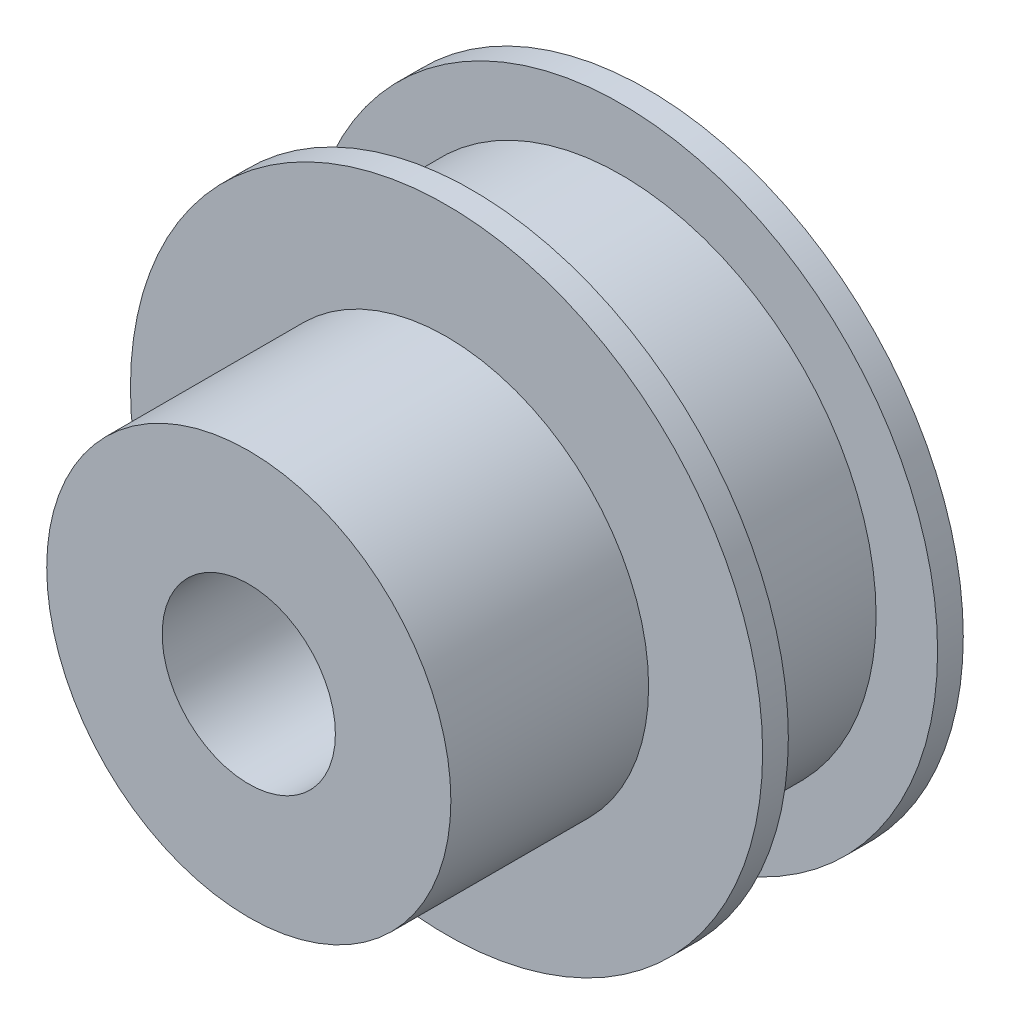
ISO-10303-21;
HEADER;
FILE_DESCRIPTION(('STEP AP214'),'2;1');
FILE_NAME('part.step','',(''),(''),'','','');
FILE_SCHEMA(('AUTOMOTIVE_DESIGN { 1 0 10303 214 1 1 1 1 }'));
ENDSEC;
DATA;
#1=APPLICATION_CONTEXT('core data for automotive mechanical design processes');
#2=APPLICATION_PROTOCOL_DEFINITION('international standard','automotive_design',2000,#1);
#3=PRODUCT_CONTEXT('',#1,'mechanical');
#4=PRODUCT('Part','Part','',(#3));
#5=PRODUCT_RELATED_PRODUCT_CATEGORY('part','',(#4));
#6=PRODUCT_DEFINITION_FORMATION('','',#4);
#7=PRODUCT_DEFINITION_CONTEXT('part definition',#1,'design');
#8=PRODUCT_DEFINITION('design','',#6,#7);
#9=PRODUCT_DEFINITION_SHAPE('','',#8);
#10=(LENGTH_UNIT() NAMED_UNIT(*) SI_UNIT(.MILLI.,.METRE.));
#11=(NAMED_UNIT(*) PLANE_ANGLE_UNIT() SI_UNIT($,.RADIAN.));
#12=(NAMED_UNIT(*) SI_UNIT($,.STERADIAN.) SOLID_ANGLE_UNIT());
#13=UNCERTAINTY_MEASURE_WITH_UNIT(LENGTH_MEASURE(1.E-05),#10,'distance_accuracy_value','');
#14=(GEOMETRIC_REPRESENTATION_CONTEXT(3) GLOBAL_UNCERTAINTY_ASSIGNED_CONTEXT((#13)) GLOBAL_UNIT_ASSIGNED_CONTEXT((#10,
#11,#12)) REPRESENTATION_CONTEXT('',''));
#15=CARTESIAN_POINT('',(0.,0.,0.));
#16=DIRECTION('',(0.,0.,1.));
#17=DIRECTION('',(1.,0.,0.));
#18=AXIS2_PLACEMENT_3D('',#15,#16,#17);
#19=CARTESIAN_POINT('',(0.,8.88999999999999,0.));
#20=DIRECTION('',(0.,0.,-1.));
#21=DIRECTION('',(-1.,0.,0.));
#22=AXIS2_PLACEMENT_3D('',#19,#20,#21);
#23=PLANE('',#22);
#24=CARTESIAN_POINT('',(0.,0.,0.));
#25=DIRECTION('',(0.,0.,1.));
#26=DIRECTION('',(1.,0.,0.));
#27=AXIS2_PLACEMENT_3D('',#24,#25,#26);
#28=CIRCLE('',#27,3.81);
#29=CARTESIAN_POINT('',(3.81,0.,0.));
#30=VERTEX_POINT('',#29);
#31=EDGE_CURVE('E10',#30,#30,#28,.T.);
#32=ORIENTED_EDGE('',*,*,#31,.F.);
#33=EDGE_LOOP('',(#32));
#34=FACE_BOUND('',#33,.T.);
#35=CARTESIAN_POINT('',(0.,0.,0.));
#36=DIRECTION('',(0.,0.,1.));
#37=DIRECTION('',(1.,0.,0.));
#38=AXIS2_PLACEMENT_3D('',#35,#36,#37);
#39=CIRCLE('',#38,8.88999999999999);
#40=CARTESIAN_POINT('',(8.88999999999999,0.,0.));
#41=VERTEX_POINT('',#40);
#42=EDGE_CURVE('E65',#41,#41,#39,.T.);
#43=ORIENTED_EDGE('',*,*,#42,.T.);
#44=EDGE_LOOP('',(#43));
#45=FACE_BOUND('',#44,.T.);
#46=ADVANCED_FACE('F31',(#34,#45),#23,.F.);
#47=CARTESIAN_POINT('',(0.,0.,0.));
#48=DIRECTION('',(0.,0.,1.));
#49=DIRECTION('',(1.,0.,0.));
#50=AXIS2_PLACEMENT_3D('',#47,#48,#49);
#51=CYLINDRICAL_SURFACE('',#50,3.81);
#52=CARTESIAN_POINT('',(0.,0.,-17.526));
#53=DIRECTION('',(0.,0.,1.));
#54=DIRECTION('',(1.,0.,0.));
#55=AXIS2_PLACEMENT_3D('',#52,#53,#54);
#56=CIRCLE('',#55,3.81);
#57=CARTESIAN_POINT('',(3.81,0.,-17.526));
#58=VERTEX_POINT('',#57);
#59=EDGE_CURVE('E37',#58,#58,#56,.T.);
#60=ORIENTED_EDGE('',*,*,#59,.F.);
#61=EDGE_LOOP('',(#60));
#62=FACE_BOUND('',#61,.T.);
#63=ORIENTED_EDGE('',*,*,#31,.T.);
#64=EDGE_LOOP('',(#63));
#65=FACE_BOUND('',#64,.T.);
#66=ADVANCED_FACE('F114',(#62,#65),#51,.F.);
#67=CARTESIAN_POINT('',(0.,3.81,-17.526));
#68=DIRECTION('',(0.,0.,1.));
#69=DIRECTION('',(1.,0.,0.));
#70=AXIS2_PLACEMENT_3D('',#67,#68,#69);
#71=PLANE('',#70);
#72=CARTESIAN_POINT('',(0.,0.,-17.526));
#73=DIRECTION('',(0.,0.,1.));
#74=DIRECTION('',(1.,0.,0.));
#75=AXIS2_PLACEMENT_3D('',#72,#73,#74);
#76=CIRCLE('',#75,13.9065);
#77=CARTESIAN_POINT('',(13.9065,0.,-17.526));
#78=VERTEX_POINT('',#77);
#79=EDGE_CURVE('E41',#78,#78,#76,.T.);
#80=ORIENTED_EDGE('',*,*,#79,.F.);
#81=EDGE_LOOP('',(#80));
#82=FACE_BOUND('',#81,.T.);
#83=ORIENTED_EDGE('',*,*,#59,.T.);
#84=EDGE_LOOP('',(#83));
#85=FACE_BOUND('',#84,.T.);
#86=ADVANCED_FACE('F109',(#82,#85),#71,.F.);
#87=CARTESIAN_POINT('',(0.,0.,0.));
#88=DIRECTION('',(0.,0.,1.));
#89=DIRECTION('',(1.,0.,0.));
#90=AXIS2_PLACEMENT_3D('',#87,#88,#89);
#91=CYLINDRICAL_SURFACE('',#90,13.9065);
#92=CARTESIAN_POINT('',(0.,0.,-16.3957));
#93=DIRECTION('',(0.,0.,1.));
#94=DIRECTION('',(1.,0.,0.));
#95=AXIS2_PLACEMENT_3D('',#92,#93,#94);
#96=CIRCLE('',#95,13.9065);
#97=CARTESIAN_POINT('',(13.9065,0.,-16.3957));
#98=VERTEX_POINT('',#97);
#99=EDGE_CURVE('E45',#98,#98,#96,.T.);
#100=ORIENTED_EDGE('',*,*,#99,.F.);
#101=EDGE_LOOP('',(#100));
#102=FACE_BOUND('',#101,.T.);
#103=ORIENTED_EDGE('',*,*,#79,.T.);
#104=EDGE_LOOP('',(#103));
#105=FACE_BOUND('',#104,.T.);
#106=ADVANCED_FACE('F103',(#102,#105),#91,.T.);
#107=CARTESIAN_POINT('',(0.,13.9065,-16.3957));
#108=DIRECTION('',(0.,0.,-1.));
#109=DIRECTION('',(-1.,0.,0.));
#110=AXIS2_PLACEMENT_3D('',#107,#108,#109);
#111=PLANE('',#110);
#112=CARTESIAN_POINT('',(0.,0.,-16.3957));
#113=DIRECTION('',(0.,0.,1.));
#114=DIRECTION('',(1.,0.,0.));
#115=AXIS2_PLACEMENT_3D('',#112,#113,#114);
#116=CIRCLE('',#115,11.2014);
#117=CARTESIAN_POINT('',(11.2014,0.,-16.3957));
#118=VERTEX_POINT('',#117);
#119=EDGE_CURVE('E50',#118,#118,#116,.T.);
#120=ORIENTED_EDGE('',*,*,#119,.F.);
#121=EDGE_LOOP('',(#120));
#122=FACE_BOUND('',#121,.T.);
#123=ORIENTED_EDGE('',*,*,#99,.T.);
#124=EDGE_LOOP('',(#123));
#125=FACE_BOUND('',#124,.T.);
#126=ADVANCED_FACE('F97',(#122,#125),#111,.F.);
#127=CARTESIAN_POINT('',(0.,0.,0.));
#128=DIRECTION('',(0.,0.,1.));
#129=DIRECTION('',(1.,0.,0.));
#130=AXIS2_PLACEMENT_3D('',#127,#128,#129);
#131=CYLINDRICAL_SURFACE('',#130,11.2014);
#132=CARTESIAN_POINT('',(0.,0.,-9.8298));
#133=DIRECTION('',(0.,0.,1.));
#134=DIRECTION('',(1.,0.,0.));
#135=AXIS2_PLACEMENT_3D('',#132,#133,#134);
#136=CIRCLE('',#135,11.2014);
#137=CARTESIAN_POINT('',(11.2014,0.,-9.8298));
#138=VERTEX_POINT('',#137);
#139=EDGE_CURVE('E53',#138,#138,#136,.T.);
#140=ORIENTED_EDGE('',*,*,#139,.F.);
#141=EDGE_LOOP('',(#140));
#142=FACE_BOUND('',#141,.T.);
#143=ORIENTED_EDGE('',*,*,#119,.T.);
#144=EDGE_LOOP('',(#143));
#145=FACE_BOUND('',#144,.T.);
#146=ADVANCED_FACE('F91',(#142,#145),#131,.T.);
#147=CARTESIAN_POINT('',(0.,11.2014,-9.8298));
#148=DIRECTION('',(0.,0.,1.));
#149=DIRECTION('',(1.,0.,0.));
#150=AXIS2_PLACEMENT_3D('',#147,#148,#149);
#151=PLANE('',#150);
#152=CARTESIAN_POINT('',(0.,0.,-9.8298));
#153=DIRECTION('',(0.,0.,1.));
#154=DIRECTION('',(1.,0.,0.));
#155=AXIS2_PLACEMENT_3D('',#152,#153,#154);
#156=CIRCLE('',#155,13.9065);
#157=CARTESIAN_POINT('',(13.9065,0.,-9.8298));
#158=VERTEX_POINT('',#157);
#159=EDGE_CURVE('E56',#158,#158,#156,.T.);
#160=ORIENTED_EDGE('',*,*,#159,.F.);
#161=EDGE_LOOP('',(#160));
#162=FACE_BOUND('',#161,.T.);
#163=ORIENTED_EDGE('',*,*,#139,.T.);
#164=EDGE_LOOP('',(#163));
#165=FACE_BOUND('',#164,.T.);
#166=ADVANCED_FACE('F85',(#162,#165),#151,.F.);
#167=CARTESIAN_POINT('',(0.,0.,0.));
#168=DIRECTION('',(0.,0.,1.));
#169=DIRECTION('',(1.,0.,0.));
#170=AXIS2_PLACEMENT_3D('',#167,#168,#169);
#171=CYLINDRICAL_SURFACE('',#170,13.9065);
#172=CARTESIAN_POINT('',(0.,0.,-8.6995));
#173=DIRECTION('',(0.,0.,1.));
#174=DIRECTION('',(1.,0.,0.));
#175=AXIS2_PLACEMENT_3D('',#172,#173,#174);
#176=CIRCLE('',#175,13.9065);
#177=CARTESIAN_POINT('',(13.9065,0.,-8.6995));
#178=VERTEX_POINT('',#177);
#179=EDGE_CURVE('E59',#178,#178,#176,.T.);
#180=ORIENTED_EDGE('',*,*,#179,.F.);
#181=EDGE_LOOP('',(#180));
#182=FACE_BOUND('',#181,.T.);
#183=ORIENTED_EDGE('',*,*,#159,.T.);
#184=EDGE_LOOP('',(#183));
#185=FACE_BOUND('',#184,.T.);
#186=ADVANCED_FACE('F79',(#182,#185),#171,.T.);
#187=CARTESIAN_POINT('',(0.,13.9065,-8.6995));
#188=DIRECTION('',(0.,0.,-1.));
#189=DIRECTION('',(-1.,0.,0.));
#190=AXIS2_PLACEMENT_3D('',#187,#188,#189);
#191=PLANE('',#190);
#192=CARTESIAN_POINT('',(0.,0.,-8.6995));
#193=DIRECTION('',(0.,0.,1.));
#194=DIRECTION('',(1.,0.,0.));
#195=AXIS2_PLACEMENT_3D('',#192,#193,#194);
#196=CIRCLE('',#195,8.88999999999999);
#197=CARTESIAN_POINT('',(8.88999999999999,0.,-8.6995));
#198=VERTEX_POINT('',#197);
#199=EDGE_CURVE('E62',#198,#198,#196,.T.);
#200=ORIENTED_EDGE('',*,*,#199,.F.);
#201=EDGE_LOOP('',(#200));
#202=FACE_BOUND('',#201,.T.);
#203=ORIENTED_EDGE('',*,*,#179,.T.);
#204=EDGE_LOOP('',(#203));
#205=FACE_BOUND('',#204,.T.);
#206=ADVANCED_FACE('F73',(#202,#205),#191,.F.);
#207=CARTESIAN_POINT('',(0.,0.,0.));
#208=DIRECTION('',(0.,0.,1.));
#209=DIRECTION('',(1.,0.,0.));
#210=AXIS2_PLACEMENT_3D('',#207,#208,#209);
#211=CYLINDRICAL_SURFACE('',#210,8.88999999999999);
#212=ORIENTED_EDGE('',*,*,#42,.F.);
#213=EDGE_LOOP('',(#212));
#214=FACE_BOUND('',#213,.T.);
#215=ORIENTED_EDGE('',*,*,#199,.T.);
#216=EDGE_LOOP('',(#215));
#217=FACE_BOUND('',#216,.T.);
#218=ADVANCED_FACE('F70',(#214,#217),#211,.T.);
#219=CLOSED_SHELL('',(#46,#66,#86,#106,#126,#146,#166,#186,#206,#218));
#220=MANIFOLD_SOLID_BREP('B2',#219);
#221=ADVANCED_BREP_SHAPE_REPRESENTATION('',(#18,#220),#14);
#222=SHAPE_DEFINITION_REPRESENTATION(#9,#221);
ENDSEC;
END-ISO-10303-21;
